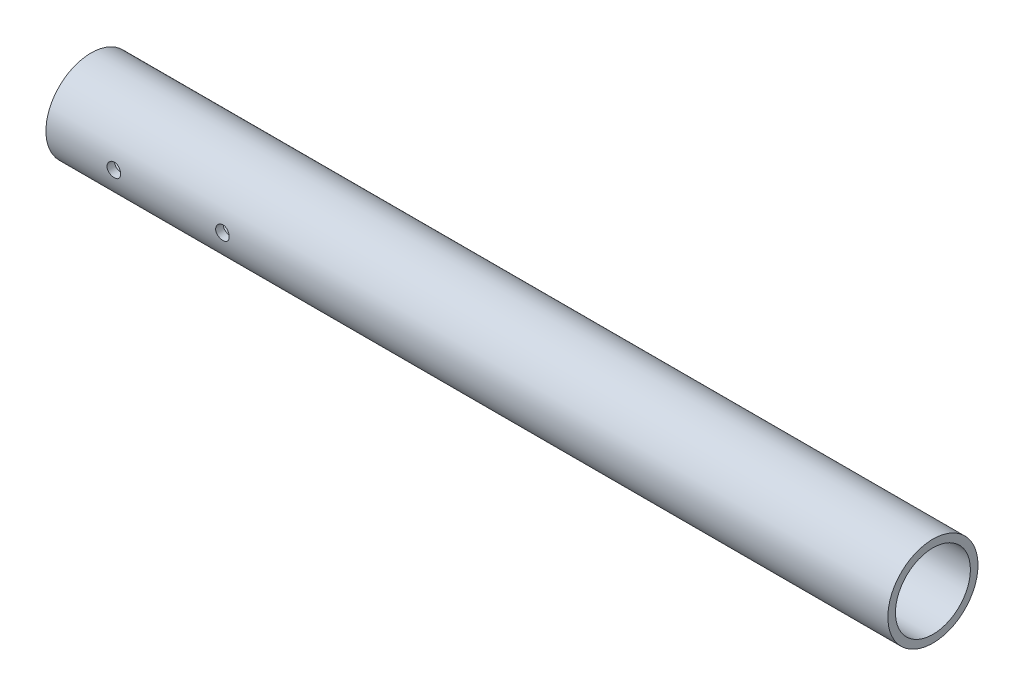
ISO-10303-21;
HEADER;
FILE_DESCRIPTION(('STEP AP214'),'2;1');
FILE_NAME('part.step','',(''),(''),'','','');
FILE_SCHEMA(('AUTOMOTIVE_DESIGN { 1 0 10303 214 1 1 1 1 }'));
ENDSEC;
DATA;
#1=APPLICATION_CONTEXT('core data for automotive mechanical design processes');
#2=APPLICATION_PROTOCOL_DEFINITION('international standard','automotive_design',2000,#1);
#3=PRODUCT_CONTEXT('',#1,'mechanical');
#4=PRODUCT('Part','Part','',(#3));
#5=PRODUCT_RELATED_PRODUCT_CATEGORY('part','',(#4));
#6=PRODUCT_DEFINITION_FORMATION('','',#4);
#7=PRODUCT_DEFINITION_CONTEXT('part definition',#1,'design');
#8=PRODUCT_DEFINITION('design','',#6,#7);
#9=PRODUCT_DEFINITION_SHAPE('','',#8);
#10=(LENGTH_UNIT() NAMED_UNIT(*) SI_UNIT(.MILLI.,.METRE.));
#11=(NAMED_UNIT(*) PLANE_ANGLE_UNIT() SI_UNIT($,.RADIAN.));
#12=(NAMED_UNIT(*) SI_UNIT($,.STERADIAN.) SOLID_ANGLE_UNIT());
#13=UNCERTAINTY_MEASURE_WITH_UNIT(LENGTH_MEASURE(1.E-05),#10,'distance_accuracy_value','');
#14=(GEOMETRIC_REPRESENTATION_CONTEXT(3) GLOBAL_UNCERTAINTY_ASSIGNED_CONTEXT((#13)) GLOBAL_UNIT_ASSIGNED_CONTEXT((#10,
#11,#12)) REPRESENTATION_CONTEXT('',''));
#15=CARTESIAN_POINT('',(0.,0.,0.));
#16=DIRECTION('',(0.,0.,1.));
#17=DIRECTION('',(1.,0.,0.));
#18=AXIS2_PLACEMENT_3D('',#15,#16,#17);
#19=CARTESIAN_POINT('',(-196.85,0.,0.));
#20=DIRECTION('',(1.,0.,0.));
#21=DIRECTION('',(0.,0.,-1.));
#22=AXIS2_PLACEMENT_3D('',#19,#20,#21);
#23=CYLINDRICAL_SURFACE('',#22,21.082);
#24=CARTESIAN_POINT('',(-196.85,0.,0.));
#25=DIRECTION('',(1.,0.,0.));
#26=DIRECTION('',(0.,0.,-1.));
#27=AXIS2_PLACEMENT_3D('',#24,#25,#26);
#28=CIRCLE('',#27,21.082);
#29=CARTESIAN_POINT('',(-196.85,0.,-21.082));
#30=VERTEX_POINT('',#29);
#31=EDGE_CURVE('E10',#30,#30,#28,.T.);
#32=ORIENTED_EDGE('',*,*,#31,.T.);
#33=EDGE_LOOP('',(#32));
#34=FACE_BOUND('',#33,.T.);
#35=CARTESIAN_POINT('',(196.85,0.,0.));
#36=DIRECTION('',(1.,0.,0.));
#37=DIRECTION('',(0.,0.,-1.));
#38=AXIS2_PLACEMENT_3D('',#35,#36,#37);
#39=CIRCLE('',#38,21.082);
#40=CARTESIAN_POINT('',(196.85,0.,-21.082));
#41=VERTEX_POINT('',#40);
#42=EDGE_CURVE('E50',#41,#41,#39,.T.);
#43=ORIENTED_EDGE('',*,*,#42,.F.);
#44=EDGE_LOOP('',(#43));
#45=FACE_BOUND('',#44,.T.);
#46=CARTESIAN_POINT('',(-168.275,0.,21.082));
#47=CARTESIAN_POINT('',(-168.274992696243,0.177265588906064,21.0819971511082));
#48=CARTESIAN_POINT('',(-168.260104327722,0.354633825443566,21.0797407978607));
#49=CARTESIAN_POINT('',(-168.200959639785,0.704412011201187,21.0709569196678));
#50=CARTESIAN_POINT('',(-168.156674780004,0.876816971803984,21.064425243998));
#51=CARTESIAN_POINT('',(-168.040090861165,1.2115560497482,21.0478246855302));
#52=CARTESIAN_POINT('',(-167.967813035828,1.37389769247854,21.0377584843423));
#53=CARTESIAN_POINT('',(-167.797346902468,1.68412370373541,21.0152009969064));
#54=CARTESIAN_POINT('',(-167.69916217104,1.8320100640365,21.0027100454717));
#55=CARTESIAN_POINT('',(-167.478845794194,2.11031643435081,20.9765819826565));
#56=CARTESIAN_POINT('',(-167.3565504399,2.24060616148059,20.9629374218632));
#57=CARTESIAN_POINT('',(-167.091836613573,2.47889671955909,20.9360982303561));
#58=CARTESIAN_POINT('',(-166.949416981135,2.58689626432784,20.9229036256421));
#59=CARTESIAN_POINT('',(-166.647621345587,2.77804840978029,20.8983859912104));
#60=CARTESIAN_POINT('',(-166.488164593206,2.86107486347093,20.8870725883659));
#61=CARTESIAN_POINT('',(-166.157370426842,2.99911783525678,20.8677000439257));
#62=CARTESIAN_POINT('',(-165.986033666236,3.05413589237425,20.8596407235276));
#63=CARTESIAN_POINT('',(-165.637713637157,3.13419550245969,20.8477621012251));
#64=CARTESIAN_POINT('',(-165.460782744137,3.15946016290709,20.8439112577396));
#65=CARTESIAN_POINT('',(-165.105154056933,3.17998699422211,20.8407898425614));
#66=CARTESIAN_POINT('',(-164.926456365603,3.17525090142445,20.8415190057945));
#67=CARTESIAN_POINT('',(-164.573943290049,3.13609297404926,20.8474463775802));
#68=CARTESIAN_POINT('',(-164.40009957517,3.101919701057,20.852607165254));
#69=CARTESIAN_POINT('',(-164.060642024393,3.00524659900985,20.8667578327125));
#70=CARTESIAN_POINT('',(-163.895028423173,2.9427459627244,20.8757478216156));
#71=CARTESIAN_POINT('',(-163.57597641876,2.79093400118089,20.8965852461813));
#72=CARTESIAN_POINT('',(-163.422588837981,2.70151746318002,20.9084438587404));
#73=CARTESIAN_POINT('',(-163.132900855916,2.49848682809598,20.9336742925736));
#74=CARTESIAN_POINT('',(-162.996601585936,2.38487113028626,20.9470462139227));
#75=CARTESIAN_POINT('',(-162.743518756676,2.13530326568608,20.9739618878807));
#76=CARTESIAN_POINT('',(-162.626945855511,1.99913740955179,20.9875060134767));
#77=CARTESIAN_POINT('',(-162.418274544488,1.70906259522473,21.0131148002247));
#78=CARTESIAN_POINT('',(-162.326176243369,1.55515355820367,21.0251794548033));
#79=CARTESIAN_POINT('',(-162.169057340399,1.23377816277263,21.0464826923882));
#80=CARTESIAN_POINT('',(-162.104053073529,1.0663036982249,21.0557195696406));
#81=CARTESIAN_POINT('',(-162.003151041654,0.722645240857121,21.070312259879));
#82=CARTESIAN_POINT('',(-161.967251292923,0.546461842495148,21.0756683373726));
#83=CARTESIAN_POINT('',(-161.925857666781,0.192204765370476,21.0818608911754));
#84=CARTESIAN_POINT('',(-161.920074191204,0.014165649847102,21.0827404122035));
#85=CARTESIAN_POINT('',(-161.938308481612,-0.340339952440584,21.0799979514801));
#86=CARTESIAN_POINT('',(-161.962325317379,-0.516806488119846,21.0763761102388));
#87=CARTESIAN_POINT('',(-162.039237666121,-0.862279899383923,21.0650645063623));
#88=CARTESIAN_POINT('',(-162.091992010307,-1.03131891039135,21.0573946347692));
#89=CARTESIAN_POINT('',(-162.224732948251,-1.35815274399451,21.0388441665934));
#90=CARTESIAN_POINT('',(-162.304720829788,-1.51594703443955,21.0279634181826));
#91=CARTESIAN_POINT('',(-162.490337139215,-1.81708511576191,21.0040933283749));
#92=CARTESIAN_POINT('',(-162.596149173084,-1.9603145348408,20.9910891189132));
#93=CARTESIAN_POINT('',(-162.830154648818,-2.22708618632573,20.9644655933992));
#94=CARTESIAN_POINT('',(-162.958349402479,-2.35062726403488,20.9508462413297));
#95=CARTESIAN_POINT('',(-163.234770906888,-2.57556977848286,20.9243908347895));
#96=CARTESIAN_POINT('',(-163.383156506261,-2.67677703259561,20.9115622997957));
#97=CARTESIAN_POINT('',(-163.694991994603,-2.8528290309045,20.888274456038));
#98=CARTESIAN_POINT('',(-163.858441473836,-2.92767449187153,20.8778150828597));
#99=CARTESIAN_POINT('',(-164.195187201683,-3.04857772519442,20.8605043047131));
#100=CARTESIAN_POINT('',(-164.368446144862,-3.09473749350594,20.8536401303661));
#101=CARTESIAN_POINT('',(-164.720368391081,-3.15728352894343,20.8442630448294));
#102=CARTESIAN_POINT('',(-164.899031316753,-3.17367187018762,20.8417498305174));
#103=CARTESIAN_POINT('',(-165.25475433616,-3.17616021106899,20.8413705974415));
#104=CARTESIAN_POINT('',(-165.431812319645,-3.16256554437416,20.8434577306442));
#105=CARTESIAN_POINT('',(-165.781093207795,-3.10612829026899,20.8519421795031));
#106=CARTESIAN_POINT('',(-165.95331612046,-3.0632857512491,20.8583394880282));
#107=CARTESIAN_POINT('',(-166.287952316415,-2.94967717748468,20.874707044174));
#108=CARTESIAN_POINT('',(-166.450373046203,-2.87893265513936,20.8846745386426));
#109=CARTESIAN_POINT('',(-166.761089428502,-2.71155871536681,20.9070627102117));
#110=CARTESIAN_POINT('',(-166.909384594736,-2.61492840724793,20.9194834717215));
#111=CARTESIAN_POINT('',(-167.189191280687,-2.39741725845486,20.9455292166376));
#112=CARTESIAN_POINT('',(-167.320526091709,-2.27631033164998,20.9591647100844));
#113=CARTESIAN_POINT('',(-167.561117181648,-2.01376149306829,20.9860159394496));
#114=CARTESIAN_POINT('',(-167.670368323069,-1.87231486257536,20.9992315770924));
#115=CARTESIAN_POINT('',(-167.864233030242,-1.57217776718591,21.0238378848768));
#116=CARTESIAN_POINT('',(-167.948706474533,-1.41339594518085,21.0352180180234));
#117=CARTESIAN_POINT('',(-168.089658721969,-1.08380087043068,21.0547677779054));
#118=CARTESIAN_POINT('',(-168.146166480664,-0.913000272113377,21.0629407235248));
#119=CARTESIAN_POINT('',(-168.216783136409,-0.617864332480806,21.0732924950954));
#120=CARTESIAN_POINT('',(-168.238581040015,-0.495349503289414,21.0765410154751));
#121=CARTESIAN_POINT('',(-168.267691941695,-0.248573261637352,21.0808957533839));
#122=CARTESIAN_POINT('',(-168.27500512194,-0.124311871162611,21.0820019978558));
#123=CARTESIAN_POINT('',(-168.275,0.,21.082));
#124=B_SPLINE_CURVE_WITH_KNOTS('',3,(#46,#47,#48,#49,#50,#51,#52,#53,#54,#55,#56,#57,#58,#59,
#60,#61,#62,#63,#64,#65,#66,#67,#68,#69,#70,#71,#72,#73,#74,#75,#76,#77,#78,#79,#80,#81,#82,#83,
#84,#85,#86,#87,#88,#89,#90,#91,#92,#93,#94,#95,#96,#97,#98,#99,#100,#101,#102,#103,#104,#105,
#106,#107,#108,#109,#110,#111,#112,#113,#114,#115,#116,#117,#118,#119,#120,#121,#122,#123),
.UNSPECIFIED.,.T.,.F.,(4,2,2,2,2,2,2,2,2,2,2,2,2,2,2,2,2,2,2,2,2,2,2,2,2,2,2,2,2,2,2,2,2,2,2,2,
2,2,4),(0.,0.53134251242904,1.06320164882559,1.59465813765312,2.12604129424768,2.66116512439553,
3.19631982343619,3.73413403476708,4.27191869076778,4.80564452954643,5.33933947849274,
5.86857170164555,6.39781900700993,6.92916258470443,7.46054132064736,7.99727852314497,
8.53401811031675,9.07108083107701,9.60810694326931,10.1399593459211,10.6717951472021,
11.2010416383702,11.730313159249,12.2634633412738,12.7966447804,13.3342937698578,
13.8719281396386,14.4076397711918,14.9433140793118,15.4735585288678,16.0038021011393,
16.5336376528597,17.0634914377811,17.5984835709691,18.1336000206728,18.6716867332597,
19.2092151415009,19.5818368843675,19.9544539408189),.UNSPECIFIED.);
#125=CARTESIAN_POINT('',(-168.275,0.,21.082));
#126=VERTEX_POINT('',#125);
#127=EDGE_CURVE('E59',#126,#126,#124,.T.);
#128=ORIENTED_EDGE('',*,*,#127,.T.);
#129=EDGE_LOOP('',(#128));
#130=FACE_BOUND('',#129,.T.);
#131=CARTESIAN_POINT('',(-117.475,0.,21.082));
#132=CARTESIAN_POINT('',(-117.474992696243,0.177265588906064,21.0819971511082));
#133=CARTESIAN_POINT('',(-117.460104327722,0.354633825443565,21.0797407978607));
#134=CARTESIAN_POINT('',(-117.400959639785,0.704412011201185,21.0709569196678));
#135=CARTESIAN_POINT('',(-117.356674780004,0.876816971803983,21.064425243998));
#136=CARTESIAN_POINT('',(-117.240090861165,1.21155604974819,21.0478246855302));
#137=CARTESIAN_POINT('',(-117.167813035828,1.37389769247853,21.0377584843423));
#138=CARTESIAN_POINT('',(-116.997346902468,1.68412370373539,21.0152009969064));
#139=CARTESIAN_POINT('',(-116.89916217104,1.83201006403648,21.0027100454717));
#140=CARTESIAN_POINT('',(-116.678845794194,2.1103164343508,20.9765819826565));
#141=CARTESIAN_POINT('',(-116.5565504399,2.24060616148058,20.9629374218632));
#142=CARTESIAN_POINT('',(-116.291836613573,2.47889671955908,20.9360982303561));
#143=CARTESIAN_POINT('',(-116.149416981135,2.58689626432783,20.9229036256421));
#144=CARTESIAN_POINT('',(-115.847621345587,2.77804840978028,20.8983859912104));
#145=CARTESIAN_POINT('',(-115.688164593206,2.86107486347092,20.8870725883659));
#146=CARTESIAN_POINT('',(-115.357370426842,2.99911783525677,20.8677000439257));
#147=CARTESIAN_POINT('',(-115.186033666236,3.05413589237424,20.8596407235276));
#148=CARTESIAN_POINT('',(-114.837713637157,3.13419550245969,20.8477621012251));
#149=CARTESIAN_POINT('',(-114.660782744137,3.15946016290709,20.8439112577396));
#150=CARTESIAN_POINT('',(-114.305154056933,3.17998699422211,20.8407898425614));
#151=CARTESIAN_POINT('',(-114.126456365603,3.17525090142445,20.8415190057945));
#152=CARTESIAN_POINT('',(-113.773943290049,3.13609297404926,20.8474463775802));
#153=CARTESIAN_POINT('',(-113.60009957517,3.101919701057,20.852607165254));
#154=CARTESIAN_POINT('',(-113.260642024393,3.00524659900985,20.8667578327125));
#155=CARTESIAN_POINT('',(-113.095028423174,2.94274596272441,20.8757478216156));
#156=CARTESIAN_POINT('',(-112.77597641876,2.7909340011809,20.8965852461813));
#157=CARTESIAN_POINT('',(-112.622588837981,2.70151746318003,20.9084438587404));
#158=CARTESIAN_POINT('',(-112.332900855916,2.498486828096,20.9336742925736));
#159=CARTESIAN_POINT('',(-112.196601585936,2.38487113028627,20.9470462139227));
#160=CARTESIAN_POINT('',(-111.943518756676,2.1353032656861,20.9739618878806));
#161=CARTESIAN_POINT('',(-111.826945855511,1.99913740955181,20.9875060134767));
#162=CARTESIAN_POINT('',(-111.618274544488,1.70906259522474,21.0131148002247));
#163=CARTESIAN_POINT('',(-111.526176243369,1.55515355820369,21.0251794548033));
#164=CARTESIAN_POINT('',(-111.369057340399,1.23377816277264,21.0464826923882));
#165=CARTESIAN_POINT('',(-111.304053073529,1.06630369822491,21.0557195696406));
#166=CARTESIAN_POINT('',(-111.203151041654,0.722645240857131,21.070312259879));
#167=CARTESIAN_POINT('',(-111.167251292923,0.546461842495156,21.0756683373726));
#168=CARTESIAN_POINT('',(-111.125857666781,0.192204765370483,21.0818608911754));
#169=CARTESIAN_POINT('',(-111.120074191204,0.0141656498471105,21.0827404122035));
#170=CARTESIAN_POINT('',(-111.138308481612,-0.340339952440575,21.0799979514801));
#171=CARTESIAN_POINT('',(-111.162325317379,-0.516806488119837,21.0763761102388));
#172=CARTESIAN_POINT('',(-111.239237666121,-0.86227989938391,21.0650645063623));
#173=CARTESIAN_POINT('',(-111.291992010307,-1.03131891039133,21.0573946347692));
#174=CARTESIAN_POINT('',(-111.424732948251,-1.35815274399449,21.0388441665934));
#175=CARTESIAN_POINT('',(-111.504720829788,-1.51594703443953,21.0279634181826));
#176=CARTESIAN_POINT('',(-111.690337139215,-1.81708511576191,21.0040933283749));
#177=CARTESIAN_POINT('',(-111.796149173084,-1.9603145348408,20.9910891189132));
#178=CARTESIAN_POINT('',(-112.030154648818,-2.22708618632573,20.9644655933992));
#179=CARTESIAN_POINT('',(-112.158349402479,-2.35062726403487,20.9508462413297));
#180=CARTESIAN_POINT('',(-112.434770906888,-2.57556977848285,20.9243908347895));
#181=CARTESIAN_POINT('',(-112.583156506261,-2.67677703259561,20.9115622997957));
#182=CARTESIAN_POINT('',(-112.894991994603,-2.85282903090451,20.888274456038));
#183=CARTESIAN_POINT('',(-113.058441473836,-2.92767449187153,20.8778150828597));
#184=CARTESIAN_POINT('',(-113.395187201683,-3.04857772519442,20.8605043047131));
#185=CARTESIAN_POINT('',(-113.568446144862,-3.09473749350594,20.8536401303661));
#186=CARTESIAN_POINT('',(-113.920368391081,-3.15728352894343,20.8442630448294));
#187=CARTESIAN_POINT('',(-114.099031316753,-3.17367187018762,20.8417498305174));
#188=CARTESIAN_POINT('',(-114.45475433616,-3.17616021106898,20.8413705974415));
#189=CARTESIAN_POINT('',(-114.631812319645,-3.16256554437416,20.8434577306442));
#190=CARTESIAN_POINT('',(-114.981093207795,-3.10612829026899,20.8519421795031));
#191=CARTESIAN_POINT('',(-115.15331612046,-3.0632857512491,20.8583394880282));
#192=CARTESIAN_POINT('',(-115.487952316415,-2.94967717748468,20.874707044174));
#193=CARTESIAN_POINT('',(-115.650373046203,-2.87893265513936,20.8846745386426));
#194=CARTESIAN_POINT('',(-115.961089428502,-2.71155871536682,20.9070627102117));
#195=CARTESIAN_POINT('',(-116.109384594736,-2.61492840724794,20.9194834717215));
#196=CARTESIAN_POINT('',(-116.389191280687,-2.39741725845485,20.9455292166376));
#197=CARTESIAN_POINT('',(-116.520526091709,-2.27631033164997,20.9591647100844));
#198=CARTESIAN_POINT('',(-116.761117181648,-2.01376149306828,20.9860159394496));
#199=CARTESIAN_POINT('',(-116.870368323069,-1.87231486257537,20.9992315770924));
#200=CARTESIAN_POINT('',(-117.064233030242,-1.57217776718592,21.0238378848768));
#201=CARTESIAN_POINT('',(-117.148706474533,-1.41339594518085,21.0352180180234));
#202=CARTESIAN_POINT('',(-117.289658721969,-1.08380087043068,21.0547677779054));
#203=CARTESIAN_POINT('',(-117.346166480664,-0.913000272113387,21.0629407235248));
#204=CARTESIAN_POINT('',(-117.416783136409,-0.617864332480819,21.0732924950954));
#205=CARTESIAN_POINT('',(-117.438581040015,-0.495349503289426,21.0765410154751));
#206=CARTESIAN_POINT('',(-117.467691941695,-0.248573261637358,21.0808957533839));
#207=CARTESIAN_POINT('',(-117.47500512194,-0.124311871162614,21.0820019978558));
#208=CARTESIAN_POINT('',(-117.475,0.,21.082));
#209=B_SPLINE_CURVE_WITH_KNOTS('',3,(#131,#132,#133,#134,#135,#136,#137,#138,#139,#140,#141,
#142,#143,#144,#145,#146,#147,#148,#149,#150,#151,#152,#153,#154,#155,#156,#157,#158,#159,#160,
#161,#162,#163,#164,#165,#166,#167,#168,#169,#170,#171,#172,#173,#174,#175,#176,#177,#178,#179,
#180,#181,#182,#183,#184,#185,#186,#187,#188,#189,#190,#191,#192,#193,#194,#195,#196,#197,#198,
#199,#200,#201,#202,#203,#204,#205,#206,#207,#208),.UNSPECIFIED.,.T.,.F.,(4,2,2,2,2,2,2,2,2,2,2,
2,2,2,2,2,2,2,2,2,2,2,2,2,2,2,2,2,2,2,2,2,2,2,2,2,2,2,4),(0.,0.531342512429038,1.06320164882558,
1.5946581376531,2.12604129424767,2.66116512439551,3.19631982343617,3.73413403476706,
4.27191869076775,4.80564452954642,5.33933947849273,5.86857170164552,6.39781900700991,
6.92916258470442,7.46054132064733,7.99727852314494,8.53401811031673,9.07108083107699,
9.6081069432693,10.1399593459211,10.6717951472021,11.2010416383702,11.730313159249,
12.2634633412738,12.7966447804,13.3342937698578,13.8719281396386,14.4076397711918,
14.9433140793118,15.4735585288678,16.0038021011393,16.5336376528597,17.0634914377811,
17.5984835709691,18.1336000206727,18.6716867332597,19.2092151415009,19.5818368843675,
19.9544539408189),.UNSPECIFIED.);
#210=CARTESIAN_POINT('',(-117.475,0.,21.082));
#211=VERTEX_POINT('',#210);
#212=EDGE_CURVE('E77',#211,#211,#209,.T.);
#213=ORIENTED_EDGE('',*,*,#212,.T.);
#214=EDGE_LOOP('',(#213));
#215=FACE_BOUND('',#214,.T.);
#216=ADVANCED_FACE('F32',(#34,#45,#130,#215),#23,.T.);
#217=CARTESIAN_POINT('',(-196.85,0.,0.));
#218=DIRECTION('',(1.,0.,0.));
#219=DIRECTION('',(0.,0.,-1.));
#220=AXIS2_PLACEMENT_3D('',#217,#218,#219);
#221=CYLINDRICAL_SURFACE('',#220,17.526);
#222=CARTESIAN_POINT('',(-196.85,0.,0.));
#223=DIRECTION('',(1.,0.,0.));
#224=DIRECTION('',(0.,0.,-1.));
#225=AXIS2_PLACEMENT_3D('',#222,#223,#224);
#226=CIRCLE('',#225,17.526);
#227=CARTESIAN_POINT('',(-196.85,0.,-17.526));
#228=VERTEX_POINT('',#227);
#229=EDGE_CURVE('E45',#228,#228,#226,.T.);
#230=ORIENTED_EDGE('',*,*,#229,.F.);
#231=EDGE_LOOP('',(#230));
#232=FACE_BOUND('',#231,.T.);
#233=CARTESIAN_POINT('',(196.85,0.,0.));
#234=DIRECTION('',(1.,0.,0.));
#235=DIRECTION('',(0.,0.,-1.));
#236=AXIS2_PLACEMENT_3D('',#233,#234,#235);
#237=CIRCLE('',#236,17.526);
#238=CARTESIAN_POINT('',(196.85,0.,-17.526));
#239=VERTEX_POINT('',#238);
#240=EDGE_CURVE('E83',#239,#239,#237,.T.);
#241=ORIENTED_EDGE('',*,*,#240,.T.);
#242=EDGE_LOOP('',(#241));
#243=FACE_BOUND('',#242,.T.);
#244=CARTESIAN_POINT('',(-168.275,0.,17.526));
#245=CARTESIAN_POINT('',(-168.274993132514,0.176790823508008,17.5259968412274));
#246=CARTESIAN_POINT('',(-168.26018396573,0.353672270747985,17.5232972774411));
#247=CARTESIAN_POINT('',(-168.201372438004,0.702458155041367,17.5127883009458));
#248=CARTESIAN_POINT('',(-168.157344740396,0.874358137310074,17.5049744534986));
#249=CARTESIAN_POINT('',(-168.041482418544,1.20808580036968,17.485111731742));
#250=CARTESIAN_POINT('',(-167.96967216344,1.3699221643449,17.4730665697294));
#251=CARTESIAN_POINT('',(-167.800350679922,1.67923272236703,17.4460593997375));
#252=CARTESIAN_POINT('',(-167.702841801324,1.82670822784651,17.4310976584752));
#253=CARTESIAN_POINT('',(-167.483729501993,2.10478127681953,17.3997234174553));
#254=CARTESIAN_POINT('',(-167.361893953305,2.23519445696565,17.3832978577657));
#255=CARTESIAN_POINT('',(-167.098086238519,2.47384671567765,17.3509451203049));
#256=CARTESIAN_POINT('',(-166.956112684689,2.58208426483874,17.3350179769725));
#257=CARTESIAN_POINT('',(-166.65476755925,2.77407084888638,17.3053386524232));
#258=CARTESIAN_POINT('',(-166.49527574471,2.8576339824516,17.2916033234658));
#259=CARTESIAN_POINT('',(-166.164227502684,2.9967100266702,17.2680459841376));
#260=CARTESIAN_POINT('',(-165.992672044777,3.05222518866685,17.2582236596927));
#261=CARTESIAN_POINT('',(-165.644333420596,3.13304110203761,17.2437354838221));
#262=CARTESIAN_POINT('',(-165.467626937035,3.15866238598857,17.2390149702052));
#263=CARTESIAN_POINT('',(-165.112365006253,3.17995782064228,17.235099927382));
#264=CARTESIAN_POINT('',(-164.933809714956,3.1756344765814,17.2359049358977));
#265=CARTESIAN_POINT('',(-164.582230051004,3.13742365897766,17.2429001682717));
#266=CARTESIAN_POINT('',(-164.409164708668,3.10389926153133,17.2490242538492));
#267=CARTESIAN_POINT('',(-164.071156214092,3.00880912932248,17.2658638407267));
#268=CARTESIAN_POINT('',(-163.906213386391,2.94724227511611,17.2765795253205));
#269=CARTESIAN_POINT('',(-163.588061936362,2.79745571266685,17.3014647929721));
#270=CARTESIAN_POINT('',(-163.434924507933,2.70908808725447,17.3156534578234));
#271=CARTESIAN_POINT('',(-163.145514150003,2.50831315208049,17.3458731721502));
#272=CARTESIAN_POINT('',(-163.009242823655,2.39590355985283,17.3619043964854));
#273=CARTESIAN_POINT('',(-162.755333896299,2.14827149301382,17.3942918762038));
#274=CARTESIAN_POINT('',(-162.637999429291,2.01273815664841,17.4106494468318));
#275=CARTESIAN_POINT('',(-162.427688621113,1.72374960651158,17.4416297211863));
#276=CARTESIAN_POINT('',(-162.334712494357,1.57029423499867,17.4562524096409));
#277=CARTESIAN_POINT('',(-162.175718396598,1.24951132270804,17.4821419521182));
#278=CARTESIAN_POINT('',(-162.109730448668,1.08216858038396,17.4934050650234));
#279=CARTESIAN_POINT('',(-162.006884348364,0.738524824278301,17.5112771866033));
#280=CARTESIAN_POINT('',(-161.970023310367,0.562224699752729,17.5178866563105));
#281=CARTESIAN_POINT('',(-161.926895827197,0.208280155645559,17.5256438790602));
#282=CARTESIAN_POINT('',(-161.920213792981,0.0306879466818512,17.5268658171028));
#283=CARTESIAN_POINT('',(-161.936521371192,-0.323076767936706,17.5239146703191));
#284=CARTESIAN_POINT('',(-161.959509626478,-0.499249338156011,17.5197418322538));
#285=CARTESIAN_POINT('',(-162.034159642385,-0.843866600411561,17.5065161011469));
#286=CARTESIAN_POINT('',(-162.085612547972,-1.01235801735562,17.4974987676082));
#287=CARTESIAN_POINT('',(-162.215506359517,-1.3383231301214,17.4755909179164));
#288=CARTESIAN_POINT('',(-162.293949001188,-1.49579611656222,17.4627001526692));
#289=CARTESIAN_POINT('',(-162.476525502701,-1.79703794282551,17.4342904171948));
#290=CARTESIAN_POINT('',(-162.580915097512,-1.94064931955918,17.4187457992515));
#291=CARTESIAN_POINT('',(-162.812074418528,-2.20846506883692,17.3868220571775));
#292=CARTESIAN_POINT('',(-162.938846086358,-2.33266775593063,17.3704428607355));
#293=CARTESIAN_POINT('',(-163.213047053409,-2.55970748627499,17.3384518393717));
#294=CARTESIAN_POINT('',(-163.360712095506,-2.66226178053652,17.3228519867864));
#295=CARTESIAN_POINT('',(-163.671417833441,-2.84110984177048,17.2944212278246));
#296=CARTESIAN_POINT('',(-163.834457982026,-2.91740454296297,17.2815902229488));
#297=CARTESIAN_POINT('',(-164.170545034343,-3.04115979533501,17.2602426012819));
#298=CARTESIAN_POINT('',(-164.34354160251,-3.08875345587471,17.2517060985603));
#299=CARTESIAN_POINT('',(-164.695243732187,-3.1541689769781,17.2398671271274));
#300=CARTESIAN_POINT('',(-164.873948695075,-3.17199394891528,17.2365641114227));
#301=CARTESIAN_POINT('',(-165.229165541857,-3.17726742876193,17.2355925385196));
#302=CARTESIAN_POINT('',(-165.405670738435,-3.16516161695717,17.2378413124165));
#303=CARTESIAN_POINT('',(-165.754086632076,-3.11188910689162,17.2475373034534));
#304=CARTESIAN_POINT('',(-165.925997352356,-3.07072255551699,17.2549844943182));
#305=CARTESIAN_POINT('',(-166.260125897203,-2.96067981082376,17.2742044563146));
#306=CARTESIAN_POINT('',(-166.422359022944,-2.8918487670874,17.2859701767276));
#307=CARTESIAN_POINT('',(-166.733046204286,-2.72847862049298,17.3125070165183));
#308=CARTESIAN_POINT('',(-166.88149937582,-2.63393786972799,17.3272783285293));
#309=CARTESIAN_POINT('',(-167.162651300551,-2.42026944589852,17.3584203635157));
#310=CARTESIAN_POINT('',(-167.295100559389,-2.30081626698694,17.37481057328));
#311=CARTESIAN_POINT('',(-167.53822420719,-2.04139533634302,17.4071948659678));
#312=CARTESIAN_POINT('',(-167.648893583025,-1.90142287454243,17.4231888569539));
#313=CARTESIAN_POINT('',(-167.846171023297,-1.60354404533996,17.4531342301883));
#314=CARTESIAN_POINT('',(-167.932571193469,-1.44549813095463,17.4670675069251));
#315=CARTESIAN_POINT('',(-168.077456942508,-1.11693687333545,17.4911451342375));
#316=CARTESIAN_POINT('',(-168.135969245347,-0.946433648982024,17.5012931100993));
#317=CARTESIAN_POINT('',(-168.211276479759,-0.646146664812287,17.5145413811557));
#318=CARTESIAN_POINT('',(-168.235132786512,-0.518138865968793,17.5188145120769));
#319=CARTESIAN_POINT('',(-168.266996893811,-0.260103700609919,17.5245449517082));
#320=CARTESIAN_POINT('',(-168.275005052851,-0.130076379844322,17.5260023241122));
#321=CARTESIAN_POINT('',(-168.275,0.,17.526));
#322=B_SPLINE_CURVE_WITH_KNOTS('',3,(#244,#245,#246,#247,#248,#249,#250,#251,#252,#253,#254,
#255,#256,#257,#258,#259,#260,#261,#262,#263,#264,#265,#266,#267,#268,#269,#270,#271,#272,#273,
#274,#275,#276,#277,#278,#279,#280,#281,#282,#283,#284,#285,#286,#287,#288,#289,#290,#291,#292,
#293,#294,#295,#296,#297,#298,#299,#300,#301,#302,#303,#304,#305,#306,#307,#308,#309,#310,#311,
#312,#313,#314,#315,#316,#317,#318,#319,#320,#321),.UNSPECIFIED.,.T.,.F.,(4,2,2,2,2,2,2,2,2,2,2,
2,2,2,2,2,2,2,2,2,2,2,2,2,2,2,2,2,2,2,2,2,2,2,2,2,2,2,4),(0.,0.52989684739867,1.06025379298762,
1.59014659312776,2.11999095802633,2.65515610450925,3.19035814774706,3.72949522868479,
4.26858902750703,4.80184775131234,5.33506186200683,5.86173930617049,6.3884377769336,
6.91809776769754,7.44780806499452,7.985299753981,8.52279617407827,9.06088891772035,
9.59892834547639,10.1295354893394,10.6601183636946,11.1868588327276,11.713633182854,
12.2458209999473,12.778055006572,13.3168607871052,13.8556473969223,14.3919156166158,
14.9281277829441,15.4564037756751,15.9846770982785,16.5120917356115,17.0395401864443,
17.5743685624972,18.1093198977252,18.648722923454,19.1876080135939,19.5774960261897,
19.9673752191978),.UNSPECIFIED.);
#323=CARTESIAN_POINT('',(-168.275,0.,17.526));
#324=VERTEX_POINT('',#323);
#325=EDGE_CURVE('E53',#324,#324,#322,.T.);
#326=ORIENTED_EDGE('',*,*,#325,.F.);
#327=EDGE_LOOP('',(#326));
#328=FACE_BOUND('',#327,.T.);
#329=CARTESIAN_POINT('',(-117.475,0.,17.526));
#330=CARTESIAN_POINT('',(-117.474993132514,0.176790823508009,17.5259968412274));
#331=CARTESIAN_POINT('',(-117.46018396573,0.353672270747986,17.5232972774411));
#332=CARTESIAN_POINT('',(-117.401372438004,0.702458155041366,17.5127883009458));
#333=CARTESIAN_POINT('',(-117.357344740396,0.874358137310071,17.5049744534986));
#334=CARTESIAN_POINT('',(-117.241482418544,1.20808580036967,17.485111731742));
#335=CARTESIAN_POINT('',(-117.16967216344,1.36992216434489,17.4730665697294));
#336=CARTESIAN_POINT('',(-117.000350679922,1.67923272236702,17.4460593997375));
#337=CARTESIAN_POINT('',(-116.902841801324,1.82670822784651,17.4310976584752));
#338=CARTESIAN_POINT('',(-116.683729501993,2.10478127681952,17.3997234174553));
#339=CARTESIAN_POINT('',(-116.561893953305,2.23519445696564,17.3832978577657));
#340=CARTESIAN_POINT('',(-116.298086238519,2.47384671567764,17.3509451203049));
#341=CARTESIAN_POINT('',(-116.156112684689,2.58208426483874,17.3350179769725));
#342=CARTESIAN_POINT('',(-115.85476755925,2.77407084888638,17.3053386524232));
#343=CARTESIAN_POINT('',(-115.69527574471,2.85763398245159,17.2916033234658));
#344=CARTESIAN_POINT('',(-115.364227502684,2.9967100266702,17.2680459841376));
#345=CARTESIAN_POINT('',(-115.192672044777,3.05222518866685,17.2582236596927));
#346=CARTESIAN_POINT('',(-114.844333420596,3.13304110203761,17.2437354838221));
#347=CARTESIAN_POINT('',(-114.667626937035,3.15866238598856,17.2390149702052));
#348=CARTESIAN_POINT('',(-114.312365006253,3.17995782064228,17.235099927382));
#349=CARTESIAN_POINT('',(-114.133809714956,3.1756344765814,17.2359049358977));
#350=CARTESIAN_POINT('',(-113.782230051004,3.13742365897766,17.2429001682717));
#351=CARTESIAN_POINT('',(-113.609164708668,3.10389926153133,17.2490242538492));
#352=CARTESIAN_POINT('',(-113.271156214092,3.00880912932249,17.2658638407267));
#353=CARTESIAN_POINT('',(-113.106213386391,2.94724227511612,17.2765795253205));
#354=CARTESIAN_POINT('',(-112.788061936362,2.79745571266688,17.3014647929721));
#355=CARTESIAN_POINT('',(-112.634924507933,2.7090880872545,17.3156534578234));
#356=CARTESIAN_POINT('',(-112.345514150003,2.50831315208051,17.3458731721502));
#357=CARTESIAN_POINT('',(-112.209242823655,2.39590355985285,17.3619043964854));
#358=CARTESIAN_POINT('',(-111.955333896299,2.14827149301383,17.3942918762038));
#359=CARTESIAN_POINT('',(-111.837999429291,2.01273815664842,17.4106494468318));
#360=CARTESIAN_POINT('',(-111.627688621113,1.72374960651159,17.4416297211863));
#361=CARTESIAN_POINT('',(-111.534712494357,1.57029423499867,17.4562524096409));
#362=CARTESIAN_POINT('',(-111.375718396598,1.24951132270804,17.4821419521182));
#363=CARTESIAN_POINT('',(-111.309730448668,1.08216858038397,17.4934050650234));
#364=CARTESIAN_POINT('',(-111.206884348364,0.73852482427832,17.5112771866033));
#365=CARTESIAN_POINT('',(-111.170023310367,0.562224699752747,17.5178866563105));
#366=CARTESIAN_POINT('',(-111.126895827197,0.208280155645574,17.5256438790602));
#367=CARTESIAN_POINT('',(-111.120213792981,0.0306879466818639,17.5268658171028));
#368=CARTESIAN_POINT('',(-111.136521371192,-0.323076767936695,17.5239146703191));
#369=CARTESIAN_POINT('',(-111.159509626478,-0.499249338156001,17.5197418322538));
#370=CARTESIAN_POINT('',(-111.234159642385,-0.843866600411554,17.5065161011469));
#371=CARTESIAN_POINT('',(-111.285612547972,-1.01235801735561,17.4974987676082));
#372=CARTESIAN_POINT('',(-111.415506359517,-1.33832313012139,17.4755909179164));
#373=CARTESIAN_POINT('',(-111.493949001188,-1.49579611656221,17.4627001526692));
#374=CARTESIAN_POINT('',(-111.676525502701,-1.7970379428255,17.4342904171948));
#375=CARTESIAN_POINT('',(-111.780915097512,-1.94064931955918,17.4187457992515));
#376=CARTESIAN_POINT('',(-112.012074418528,-2.20846506883692,17.3868220571775));
#377=CARTESIAN_POINT('',(-112.138846086358,-2.33266775593063,17.3704428607355));
#378=CARTESIAN_POINT('',(-112.413047053409,-2.55970748627499,17.3384518393717));
#379=CARTESIAN_POINT('',(-112.560712095506,-2.66226178053652,17.3228519867864));
#380=CARTESIAN_POINT('',(-112.871417833441,-2.84110984177048,17.2944212278246));
#381=CARTESIAN_POINT('',(-113.034457982026,-2.91740454296296,17.2815902229488));
#382=CARTESIAN_POINT('',(-113.370545034343,-3.04115979533501,17.2602426012819));
#383=CARTESIAN_POINT('',(-113.54354160251,-3.08875345587471,17.2517060985603));
#384=CARTESIAN_POINT('',(-113.895243732187,-3.15416897697809,17.2398671271274));
#385=CARTESIAN_POINT('',(-114.073948695075,-3.17199394891527,17.2365641114227));
#386=CARTESIAN_POINT('',(-114.429165541857,-3.17726742876193,17.2355925385196));
#387=CARTESIAN_POINT('',(-114.605670738435,-3.16516161695717,17.2378413124165));
#388=CARTESIAN_POINT('',(-114.954086632076,-3.11188910689162,17.2475373034534));
#389=CARTESIAN_POINT('',(-115.125997352356,-3.07072255551699,17.2549844943182));
#390=CARTESIAN_POINT('',(-115.460125897203,-2.96067981082377,17.2742044563146));
#391=CARTESIAN_POINT('',(-115.622359022944,-2.89184876708741,17.2859701767276));
#392=CARTESIAN_POINT('',(-115.933046204286,-2.72847862049299,17.3125070165183));
#393=CARTESIAN_POINT('',(-116.08149937582,-2.633937869728,17.3272783285292));
#394=CARTESIAN_POINT('',(-116.362651300551,-2.42026944589855,17.3584203635157));
#395=CARTESIAN_POINT('',(-116.495100559389,-2.30081626698697,17.37481057328));
#396=CARTESIAN_POINT('',(-116.73822420719,-2.04139533634304,17.4071948659678));
#397=CARTESIAN_POINT('',(-116.848893583025,-1.90142287454245,17.4231888569539));
#398=CARTESIAN_POINT('',(-117.046171023297,-1.60354404533997,17.4531342301883));
#399=CARTESIAN_POINT('',(-117.132571193469,-1.44549813095465,17.4670675069251));
#400=CARTESIAN_POINT('',(-117.277456942508,-1.11693687333548,17.4911451342375));
#401=CARTESIAN_POINT('',(-117.335969245347,-0.946433648982046,17.5012931100993));
#402=CARTESIAN_POINT('',(-117.411276479759,-0.646146664812306,17.5145413811557));
#403=CARTESIAN_POINT('',(-117.435132786512,-0.518138865968811,17.5188145120769));
#404=CARTESIAN_POINT('',(-117.466996893811,-0.26010370060993,17.5245449517082));
#405=CARTESIAN_POINT('',(-117.475005052851,-0.130076379844328,17.5260023241122));
#406=CARTESIAN_POINT('',(-117.475,0.,17.526));
#407=B_SPLINE_CURVE_WITH_KNOTS('',3,(#329,#330,#331,#332,#333,#334,#335,#336,#337,#338,#339,
#340,#341,#342,#343,#344,#345,#346,#347,#348,#349,#350,#351,#352,#353,#354,#355,#356,#357,#358,
#359,#360,#361,#362,#363,#364,#365,#366,#367,#368,#369,#370,#371,#372,#373,#374,#375,#376,#377,
#378,#379,#380,#381,#382,#383,#384,#385,#386,#387,#388,#389,#390,#391,#392,#393,#394,#395,#396,
#397,#398,#399,#400,#401,#402,#403,#404,#405,#406),.UNSPECIFIED.,.T.,.F.,(4,2,2,2,2,2,2,2,2,2,2,
2,2,2,2,2,2,2,2,2,2,2,2,2,2,2,2,2,2,2,2,2,2,2,2,2,2,2,4),(0.,0.529896847398668,1.06025379298761,
1.59014659312776,2.11999095802632,2.65515610450925,3.19035814774705,3.72949522868479,
4.26858902750701,4.80184775131233,5.33506186200683,5.86173930617045,6.38843777693352,
6.91809776769748,7.4478080649945,7.98529975398098,8.52279617407827,9.06088891772032,
9.59892834547637,10.1295354893394,10.6601183636945,11.1868588327276,11.713633182854,
12.2458209999474,12.778055006572,13.3168607871052,13.8556473969222,14.3919156166157,
14.9281277829441,15.4564037756751,15.9846770982784,16.5120917356115,17.0395401864443,
17.5743685624972,18.1093198977251,18.6487229234539,19.1876080135939,19.5774960261897,
19.9673752191978),.UNSPECIFIED.);
#408=CARTESIAN_POINT('',(-117.475,0.,17.526));
#409=VERTEX_POINT('',#408);
#410=EDGE_CURVE('E36',#409,#409,#407,.T.);
#411=ORIENTED_EDGE('',*,*,#410,.F.);
#412=EDGE_LOOP('',(#411));
#413=FACE_BOUND('',#412,.T.);
#414=ADVANCED_FACE('F60',(#232,#243,#328,#413),#221,.F.);
#415=CARTESIAN_POINT('',(-196.85,0.,0.));
#416=DIRECTION('',(1.,0.,0.));
#417=DIRECTION('',(0.,0.,-1.));
#418=AXIS2_PLACEMENT_3D('',#415,#416,#417);
#419=PLANE('',#418);
#420=ORIENTED_EDGE('',*,*,#229,.T.);
#421=EDGE_LOOP('',(#420));
#422=FACE_BOUND('',#421,.T.);
#423=ORIENTED_EDGE('',*,*,#31,.F.);
#424=EDGE_LOOP('',(#423));
#425=FACE_BOUND('',#424,.T.);
#426=ADVANCED_FACE('F102',(#422,#425),#419,.F.);
#427=CARTESIAN_POINT('',(196.85,0.,0.));
#428=DIRECTION('',(1.,0.,0.));
#429=DIRECTION('',(0.,0.,-1.));
#430=AXIS2_PLACEMENT_3D('',#427,#428,#429);
#431=PLANE('',#430);
#432=ORIENTED_EDGE('',*,*,#42,.T.);
#433=EDGE_LOOP('',(#432));
#434=FACE_BOUND('',#433,.T.);
#435=ORIENTED_EDGE('',*,*,#240,.F.);
#436=EDGE_LOOP('',(#435));
#437=FACE_BOUND('',#436,.T.);
#438=ADVANCED_FACE('F67',(#434,#437),#431,.T.);
#439=CARTESIAN_POINT('',(-165.1,0.,21.082));
#440=DIRECTION('',(0.,0.,-1.));
#441=DIRECTION('',(-1.,0.,0.));
#442=AXIS2_PLACEMENT_3D('',#439,#440,#441);
#443=CYLINDRICAL_SURFACE('',#442,3.17500000000009);
#444=ORIENTED_EDGE('',*,*,#127,.F.);
#445=EDGE_LOOP('',(#444));
#446=FACE_BOUND('',#445,.T.);
#447=ORIENTED_EDGE('',*,*,#325,.T.);
#448=EDGE_LOOP('',(#447));
#449=FACE_BOUND('',#448,.T.);
#450=ADVANCED_FACE('F63',(#446,#449),#443,.F.);
#451=CARTESIAN_POINT('',(-114.3,0.,21.082));
#452=DIRECTION('',(0.,0.,-1.));
#453=DIRECTION('',(-1.,0.,0.));
#454=AXIS2_PLACEMENT_3D('',#451,#452,#453);
#455=CYLINDRICAL_SURFACE('',#454,3.17500000000008);
#456=ORIENTED_EDGE('',*,*,#212,.F.);
#457=EDGE_LOOP('',(#456));
#458=FACE_BOUND('',#457,.T.);
#459=ORIENTED_EDGE('',*,*,#410,.T.);
#460=EDGE_LOOP('',(#459));
#461=FACE_BOUND('',#460,.T.);
#462=ADVANCED_FACE('F66',(#458,#461),#455,.F.);
#463=CLOSED_SHELL('',(#216,#414,#426,#438,#450,#462));
#464=MANIFOLD_SOLID_BREP('B2',#463);
#465=ADVANCED_BREP_SHAPE_REPRESENTATION('',(#18,#464),#14);
#466=SHAPE_DEFINITION_REPRESENTATION(#9,#465);
ENDSEC;
END-ISO-10303-21;
